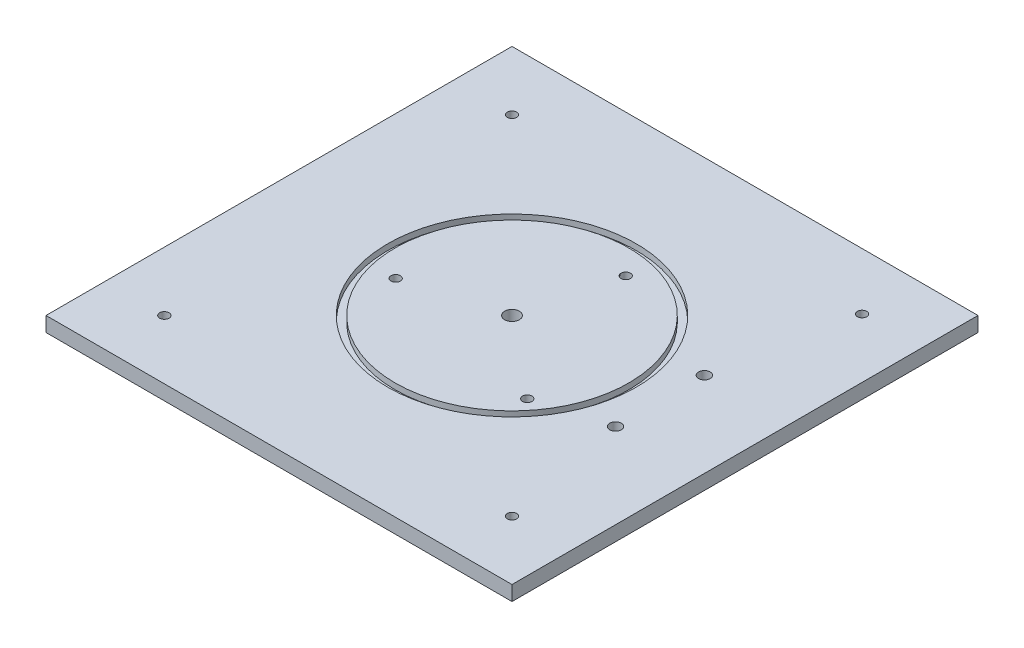
ISO-10303-21;
HEADER;
FILE_DESCRIPTION(('STEP AP214'),'2;1');
FILE_NAME('part.step','',(''),(''),'','','');
FILE_SCHEMA(('AUTOMOTIVE_DESIGN { 1 0 10303 214 1 1 1 1 }'));
ENDSEC;
DATA;
#1=APPLICATION_CONTEXT('core data for automotive mechanical design processes');
#2=APPLICATION_PROTOCOL_DEFINITION('international standard','automotive_design',2000,#1);
#3=PRODUCT_CONTEXT('',#1,'mechanical');
#4=PRODUCT('Part','Part','',(#3));
#5=PRODUCT_RELATED_PRODUCT_CATEGORY('part','',(#4));
#6=PRODUCT_DEFINITION_FORMATION('','',#4);
#7=PRODUCT_DEFINITION_CONTEXT('part definition',#1,'design');
#8=PRODUCT_DEFINITION('design','',#6,#7);
#9=PRODUCT_DEFINITION_SHAPE('','',#8);
#10=(LENGTH_UNIT() NAMED_UNIT(*) SI_UNIT(.MILLI.,.METRE.));
#11=(NAMED_UNIT(*) PLANE_ANGLE_UNIT() SI_UNIT($,.RADIAN.));
#12=(NAMED_UNIT(*) SI_UNIT($,.STERADIAN.) SOLID_ANGLE_UNIT());
#13=UNCERTAINTY_MEASURE_WITH_UNIT(LENGTH_MEASURE(1.E-05),#10,'distance_accuracy_value','');
#14=(GEOMETRIC_REPRESENTATION_CONTEXT(3) GLOBAL_UNCERTAINTY_ASSIGNED_CONTEXT((#13)) GLOBAL_UNIT_ASSIGNED_CONTEXT((#10,
#11,#12)) REPRESENTATION_CONTEXT('',''));
#15=CARTESIAN_POINT('',(0.,0.,0.));
#16=DIRECTION('',(0.,0.,1.));
#17=DIRECTION('',(1.,0.,0.));
#18=AXIS2_PLACEMENT_3D('',#15,#16,#17);
#19=CARTESIAN_POINT('',(0.,6.35,0.));
#20=DIRECTION('',(0.,1.,0.));
#21=DIRECTION('',(0.,0.,1.));
#22=AXIS2_PLACEMENT_3D('',#19,#20,#21);
#23=PLANE('',#22);
#24=CARTESIAN_POINT('',(9.69330275584784,6.35,-39.1400547767288));
#25=DIRECTION('',(0.,1.,0.));
#26=DIRECTION('',(0.,0.,1.));
#27=AXIS2_PLACEMENT_3D('',#24,#25,#26);
#28=CIRCLE('',#27,2.01929999999999);
#29=CARTESIAN_POINT('',(9.69330275584784,6.35,-37.1207547767289));
#30=VERTEX_POINT('',#29);
#31=EDGE_CURVE('E126',#30,#30,#28,.T.);
#32=ORIENTED_EDGE('',*,*,#31,.F.);
#33=EDGE_LOOP('',(#32));
#34=FACE_BOUND('',#33,.T.);
#35=CARTESIAN_POINT('',(-38.7429331202176,6.35,11.1753809551668));
#36=DIRECTION('',(0.,1.,0.));
#37=DIRECTION('',(0.,0.,1.));
#38=AXIS2_PLACEMENT_3D('',#35,#36,#37);
#39=CIRCLE('',#38,2.01929999999999);
#40=CARTESIAN_POINT('',(-38.7429331202176,6.35,13.1946809551668));
#41=VERTEX_POINT('',#40);
#42=EDGE_CURVE('E116',#41,#41,#39,.T.);
#43=ORIENTED_EDGE('',*,*,#42,.F.);
#44=EDGE_LOOP('',(#43));
#45=FACE_BOUND('',#44,.T.);
#46=CARTESIAN_POINT('',(34.2256428936894,6.35,27.6831374155974));
#47=DIRECTION('',(0.,1.,0.));
#48=DIRECTION('',(0.,0.,1.));
#49=AXIS2_PLACEMENT_3D('',#46,#47,#48);
#50=CIRCLE('',#49,2.01929999999999);
#51=CARTESIAN_POINT('',(34.2256428936894,6.35,29.7024374155973));
#52=VERTEX_POINT('',#51);
#53=EDGE_CURVE('E113',#52,#52,#50,.T.);
#54=ORIENTED_EDGE('',*,*,#53,.F.);
#55=EDGE_LOOP('',(#54));
#56=FACE_BOUND('',#55,.T.);
#57=CARTESIAN_POINT('',(0.,6.35,0.));
#58=DIRECTION('',(0.,1.,0.));
#59=DIRECTION('',(0.,0.,1.));
#60=AXIS2_PLACEMENT_3D('',#57,#58,#59);
#61=CIRCLE('',#60,3.175);
#62=CARTESIAN_POINT('',(0.,6.35,3.17499999999999));
#63=VERTEX_POINT('',#62);
#64=EDGE_CURVE('E151',#63,#63,#61,.T.);
#65=ORIENTED_EDGE('',*,*,#64,.F.);
#66=EDGE_LOOP('',(#65));
#67=FACE_BOUND('',#66,.T.);
#68=CARTESIAN_POINT('',(1.11022302462516E-13,6.35,0.));
#69=DIRECTION('',(0.,1.,0.));
#70=DIRECTION('',(0.,0.,1.));
#71=AXIS2_PLACEMENT_3D('',#68,#69,#70);
#72=CIRCLE('',#71,50.1649999999997);
#73=CARTESIAN_POINT('',(1.11022302462516E-13,6.35,50.1649999999997));
#74=VERTEX_POINT('',#73);
#75=EDGE_CURVE('E112',#74,#74,#72,.T.);
#76=ORIENTED_EDGE('',*,*,#75,.T.);
#77=EDGE_LOOP('',(#76));
#78=FACE_BOUND('',#77,.T.);
#79=ADVANCED_FACE('F34',(#34,#45,#56,#67,#78),#23,.T.);
#80=CARTESIAN_POINT('',(100.,6.35,-100.));
#81=DIRECTION('',(-1.,0.,0.));
#82=DIRECTION('',(0.,0.,1.));
#83=AXIS2_PLACEMENT_3D('',#80,#81,#82);
#84=PLANE('',#83);
#85=DIRECTION('',(0.,0.,-1.));
#86=VECTOR('',#85,1.);
#87=CARTESIAN_POINT('',(100.,0.,-100.));
#88=LINE('',#87,#86);
#89=CARTESIAN_POINT('',(100.,0.,100.));
#90=VERTEX_POINT('',#89);
#91=CARTESIAN_POINT('',(100.,0.,-100.));
#92=VERTEX_POINT('',#91);
#93=EDGE_CURVE('E101',#90,#92,#88,.T.);
#94=ORIENTED_EDGE('',*,*,#93,.T.);
#95=DIRECTION('',(0.,-1.,0.));
#96=VECTOR('',#95,1.);
#97=CARTESIAN_POINT('',(100.,6.35,-100.));
#98=LINE('',#97,#96);
#99=CARTESIAN_POINT('',(100.,6.35,-100.));
#100=VERTEX_POINT('',#99);
#101=EDGE_CURVE('E11',#100,#92,#98,.T.);
#102=ORIENTED_EDGE('',*,*,#101,.F.);
#103=DIRECTION('',(0.,0.,-1.));
#104=VECTOR('',#103,1.);
#105=CARTESIAN_POINT('',(100.,6.35,-100.));
#106=LINE('',#105,#104);
#107=CARTESIAN_POINT('',(100.,6.35,100.));
#108=VERTEX_POINT('',#107);
#109=EDGE_CURVE('E88',#108,#100,#106,.T.);
#110=ORIENTED_EDGE('',*,*,#109,.F.);
#111=DIRECTION('',(0.,-1.,0.));
#112=VECTOR('',#111,1.);
#113=CARTESIAN_POINT('',(100.,6.35,100.));
#114=LINE('',#113,#112);
#115=EDGE_CURVE('E97',#108,#90,#114,.T.);
#116=ORIENTED_EDGE('',*,*,#115,.T.);
#117=EDGE_LOOP('',(#94,#102,#110,#116));
#118=FACE_BOUND('',#117,.T.);
#119=ADVANCED_FACE('F36',(#118),#84,.F.);
#120=CARTESIAN_POINT('',(-100.,6.35,-100.));
#121=DIRECTION('',(0.,0.,1.));
#122=DIRECTION('',(1.,0.,0.));
#123=AXIS2_PLACEMENT_3D('',#120,#121,#122);
#124=PLANE('',#123);
#125=DIRECTION('',(-1.,0.,0.));
#126=VECTOR('',#125,1.);
#127=CARTESIAN_POINT('',(-100.,0.,-100.));
#128=LINE('',#127,#126);
#129=CARTESIAN_POINT('',(-100.,0.,-100.));
#130=VERTEX_POINT('',#129);
#131=EDGE_CURVE('E92',#92,#130,#128,.T.);
#132=ORIENTED_EDGE('',*,*,#131,.T.);
#133=DIRECTION('',(0.,-1.,0.));
#134=VECTOR('',#133,1.);
#135=CARTESIAN_POINT('',(-100.,6.35,-100.));
#136=LINE('',#135,#134);
#137=CARTESIAN_POINT('',(-100.,6.35,-100.));
#138=VERTEX_POINT('',#137);
#139=EDGE_CURVE('E44',#138,#130,#136,.T.);
#140=ORIENTED_EDGE('',*,*,#139,.F.);
#141=DIRECTION('',(-1.,0.,0.));
#142=VECTOR('',#141,1.);
#143=CARTESIAN_POINT('',(-100.,6.35,-100.));
#144=LINE('',#143,#142);
#145=EDGE_CURVE('E83',#100,#138,#144,.T.);
#146=ORIENTED_EDGE('',*,*,#145,.F.);
#147=ORIENTED_EDGE('',*,*,#101,.T.);
#148=EDGE_LOOP('',(#132,#140,#146,#147));
#149=FACE_BOUND('',#148,.T.);
#150=ADVANCED_FACE('F91',(#149),#124,.F.);
#151=CARTESIAN_POINT('',(-100.,6.35,-100.));
#152=DIRECTION('',(1.,0.,0.));
#153=DIRECTION('',(0.,0.,-1.));
#154=AXIS2_PLACEMENT_3D('',#151,#152,#153);
#155=PLANE('',#154);
#156=DIRECTION('',(0.,0.,1.));
#157=VECTOR('',#156,1.);
#158=CARTESIAN_POINT('',(-100.,0.,-100.));
#159=LINE('',#158,#157);
#160=CARTESIAN_POINT('',(-100.,0.,100.));
#161=VERTEX_POINT('',#160);
#162=EDGE_CURVE('E70',#130,#161,#159,.T.);
#163=ORIENTED_EDGE('',*,*,#162,.T.);
#164=DIRECTION('',(0.,-1.,0.));
#165=VECTOR('',#164,1.);
#166=CARTESIAN_POINT('',(-100.,6.35,100.));
#167=LINE('',#166,#165);
#168=CARTESIAN_POINT('',(-100.,6.35,100.));
#169=VERTEX_POINT('',#168);
#170=EDGE_CURVE('E93',#169,#161,#167,.T.);
#171=ORIENTED_EDGE('',*,*,#170,.F.);
#172=DIRECTION('',(0.,0.,1.));
#173=VECTOR('',#172,1.);
#174=CARTESIAN_POINT('',(-100.,6.35,-100.));
#175=LINE('',#174,#173);
#176=EDGE_CURVE('E86',#138,#169,#175,.T.);
#177=ORIENTED_EDGE('',*,*,#176,.F.);
#178=ORIENTED_EDGE('',*,*,#139,.T.);
#179=EDGE_LOOP('',(#163,#171,#177,#178));
#180=FACE_BOUND('',#179,.T.);
#181=ADVANCED_FACE('F95',(#180),#155,.F.);
#182=CARTESIAN_POINT('',(-100.,6.35,100.));
#183=DIRECTION('',(0.,0.,-1.));
#184=DIRECTION('',(-1.,0.,0.));
#185=AXIS2_PLACEMENT_3D('',#182,#183,#184);
#186=PLANE('',#185);
#187=DIRECTION('',(1.,0.,0.));
#188=VECTOR('',#187,1.);
#189=CARTESIAN_POINT('',(-100.,0.,100.));
#190=LINE('',#189,#188);
#191=EDGE_CURVE('E76',#161,#90,#190,.T.);
#192=ORIENTED_EDGE('',*,*,#191,.T.);
#193=ORIENTED_EDGE('',*,*,#115,.F.);
#194=DIRECTION('',(1.,0.,0.));
#195=VECTOR('',#194,1.);
#196=CARTESIAN_POINT('',(-100.,6.35,100.));
#197=LINE('',#196,#195);
#198=EDGE_CURVE('E53',#169,#108,#197,.T.);
#199=ORIENTED_EDGE('',*,*,#198,.F.);
#200=ORIENTED_EDGE('',*,*,#170,.T.);
#201=EDGE_LOOP('',(#192,#193,#199,#200));
#202=FACE_BOUND('',#201,.T.);
#203=ADVANCED_FACE('F201',(#202),#186,.F.);
#204=CARTESIAN_POINT('',(-74.6,6.35,74.6));
#205=DIRECTION('',(0.,1.,0.));
#206=DIRECTION('',(0.,0.,1.));
#207=AXIS2_PLACEMENT_3D('',#204,#205,#206);
#208=CIRCLE('',#207,2.03200000000001);
#209=CARTESIAN_POINT('',(-74.6,6.35,76.632));
#210=VERTEX_POINT('',#209);
#211=EDGE_CURVE('E317',#210,#210,#208,.T.);
#212=ORIENTED_EDGE('',*,*,#211,.F.);
#213=EDGE_LOOP('',(#212));
#214=FACE_BOUND('',#213,.T.);
#215=CARTESIAN_POINT('',(74.6,6.35,74.6));
#216=DIRECTION('',(0.,1.,0.));
#217=DIRECTION('',(0.,0.,1.));
#218=AXIS2_PLACEMENT_3D('',#215,#216,#217);
#219=CIRCLE('',#218,2.01999999999999);
#220=CARTESIAN_POINT('',(74.6,6.35,76.62));
#221=VERTEX_POINT('',#220);
#222=EDGE_CURVE('E319',#221,#221,#219,.T.);
#223=ORIENTED_EDGE('',*,*,#222,.F.);
#224=EDGE_LOOP('',(#223));
#225=FACE_BOUND('',#224,.T.);
#226=CARTESIAN_POINT('',(74.6,6.35,-75.6605977766913));
#227=DIRECTION('',(0.,1.,0.));
#228=DIRECTION('',(0.,0.,1.));
#229=AXIS2_PLACEMENT_3D('',#226,#227,#228);
#230=CIRCLE('',#229,2.01999999999999);
#231=CARTESIAN_POINT('',(74.6,6.35,-73.6405977766913));
#232=VERTEX_POINT('',#231);
#233=EDGE_CURVE('E325',#232,#232,#230,.T.);
#234=ORIENTED_EDGE('',*,*,#233,.F.);
#235=EDGE_LOOP('',(#234));
#236=FACE_BOUND('',#235,.T.);
#237=CARTESIAN_POINT('',(-74.6,6.35,-74.6));
#238=DIRECTION('',(0.,1.,0.));
#239=DIRECTION('',(0.,0.,1.));
#240=AXIS2_PLACEMENT_3D('',#237,#238,#239);
#241=CIRCLE('',#240,2.01999999999999);
#242=CARTESIAN_POINT('',(-74.6,6.35,-72.58));
#243=VERTEX_POINT('',#242);
#244=EDGE_CURVE('E331',#243,#243,#241,.T.);
#245=ORIENTED_EDGE('',*,*,#244,.F.);
#246=EDGE_LOOP('',(#245));
#247=FACE_BOUND('',#246,.T.);
#248=CARTESIAN_POINT('',(1.11022302462516E-13,6.35,0.));
#249=DIRECTION('',(0.,1.,0.));
#250=DIRECTION('',(0.,0.,1.));
#251=AXIS2_PLACEMENT_3D('',#248,#249,#250);
#252=CIRCLE('',#251,53.3399999999997);
#253=CARTESIAN_POINT('',(1.11022302462516E-13,6.35,53.3399999999996));
#254=VERTEX_POINT('',#253);
#255=EDGE_CURVE('E133',#254,#254,#252,.T.);
#256=ORIENTED_EDGE('',*,*,#255,.F.);
#257=EDGE_LOOP('',(#256));
#258=FACE_BOUND('',#257,.T.);
#259=CARTESIAN_POINT('',(63.5000000000001,6.35,-19.0500000000001));
#260=DIRECTION('',(0.,1.,0.));
#261=DIRECTION('',(0.,0.,1.));
#262=AXIS2_PLACEMENT_3D('',#259,#260,#261);
#263=CIRCLE('',#262,2.48919999999999);
#264=CARTESIAN_POINT('',(63.5000000000001,6.35,-16.5608000000001));
#265=VERTEX_POINT('',#264);
#266=EDGE_CURVE('E139',#265,#265,#263,.T.);
#267=ORIENTED_EDGE('',*,*,#266,.F.);
#268=EDGE_LOOP('',(#267));
#269=FACE_BOUND('',#268,.T.);
#270=CARTESIAN_POINT('',(63.5,6.35,19.0499999999999));
#271=DIRECTION('',(0.,1.,0.));
#272=DIRECTION('',(0.,0.,1.));
#273=AXIS2_PLACEMENT_3D('',#270,#271,#272);
#274=CIRCLE('',#273,2.48919999999999);
#275=CARTESIAN_POINT('',(63.5,6.35,21.5391999999999));
#276=VERTEX_POINT('',#275);
#277=EDGE_CURVE('E145',#276,#276,#274,.T.);
#278=ORIENTED_EDGE('',*,*,#277,.F.);
#279=EDGE_LOOP('',(#278));
#280=FACE_BOUND('',#279,.T.);
#281=ORIENTED_EDGE('',*,*,#109,.T.);
#282=ORIENTED_EDGE('',*,*,#145,.T.);
#283=ORIENTED_EDGE('',*,*,#176,.T.);
#284=ORIENTED_EDGE('',*,*,#198,.T.);
#285=EDGE_LOOP('',(#281,#282,#283,#284));
#286=FACE_BOUND('',#285,.T.);
#287=ADVANCED_FACE('F84',(#214,#225,#236,#247,#258,#269,#280,#286),#23,.T.);
#288=CARTESIAN_POINT('',(0.,0.,0.));
#289=DIRECTION('',(0.,1.,0.));
#290=DIRECTION('',(0.,0.,1.));
#291=AXIS2_PLACEMENT_3D('',#288,#289,#290);
#292=PLANE('',#291);
#293=CARTESIAN_POINT('',(-74.6,0.,74.6));
#294=DIRECTION('',(0.,1.,0.));
#295=DIRECTION('',(0.,0.,1.));
#296=AXIS2_PLACEMENT_3D('',#293,#294,#295);
#297=CIRCLE('',#296,2.03200000000001);
#298=CARTESIAN_POINT('',(-74.6,0.,76.632));
#299=VERTEX_POINT('',#298);
#300=EDGE_CURVE('E314',#299,#299,#297,.T.);
#301=ORIENTED_EDGE('',*,*,#300,.T.);
#302=EDGE_LOOP('',(#301));
#303=FACE_BOUND('',#302,.T.);
#304=CARTESIAN_POINT('',(74.6,0.,74.6));
#305=DIRECTION('',(0.,1.,0.));
#306=DIRECTION('',(0.,0.,1.));
#307=AXIS2_PLACEMENT_3D('',#304,#305,#306);
#308=CIRCLE('',#307,2.01999999999999);
#309=CARTESIAN_POINT('',(74.6,0.,76.62));
#310=VERTEX_POINT('',#309);
#311=EDGE_CURVE('E322',#310,#310,#308,.T.);
#312=ORIENTED_EDGE('',*,*,#311,.T.);
#313=EDGE_LOOP('',(#312));
#314=FACE_BOUND('',#313,.T.);
#315=CARTESIAN_POINT('',(74.6,0.,-75.6605977766913));
#316=DIRECTION('',(0.,1.,0.));
#317=DIRECTION('',(0.,0.,1.));
#318=AXIS2_PLACEMENT_3D('',#315,#316,#317);
#319=CIRCLE('',#318,2.01999999999999);
#320=CARTESIAN_POINT('',(74.6,0.,-73.6405977766913));
#321=VERTEX_POINT('',#320);
#322=EDGE_CURVE('E328',#321,#321,#319,.T.);
#323=ORIENTED_EDGE('',*,*,#322,.T.);
#324=EDGE_LOOP('',(#323));
#325=FACE_BOUND('',#324,.T.);
#326=CARTESIAN_POINT('',(-74.6,0.,-74.6));
#327=DIRECTION('',(0.,1.,0.));
#328=DIRECTION('',(0.,0.,1.));
#329=AXIS2_PLACEMENT_3D('',#326,#327,#328);
#330=CIRCLE('',#329,2.01999999999999);
#331=CARTESIAN_POINT('',(-74.6,0.,-72.58));
#332=VERTEX_POINT('',#331);
#333=EDGE_CURVE('E334',#332,#332,#330,.T.);
#334=ORIENTED_EDGE('',*,*,#333,.T.);
#335=EDGE_LOOP('',(#334));
#336=FACE_BOUND('',#335,.T.);
#337=CARTESIAN_POINT('',(9.69330275584784,0.,-39.1400547767288));
#338=DIRECTION('',(0.,1.,0.));
#339=DIRECTION('',(0.,0.,1.));
#340=AXIS2_PLACEMENT_3D('',#337,#338,#339);
#341=CIRCLE('',#340,2.01929999999999);
#342=CARTESIAN_POINT('',(9.69330275584784,0.,-37.1207547767288));
#343=VERTEX_POINT('',#342);
#344=EDGE_CURVE('E38',#343,#343,#341,.T.);
#345=ORIENTED_EDGE('',*,*,#344,.T.);
#346=EDGE_LOOP('',(#345));
#347=FACE_BOUND('',#346,.T.);
#348=CARTESIAN_POINT('',(-38.7429331202176,0.,11.1753809551668));
#349=DIRECTION('',(0.,1.,0.));
#350=DIRECTION('',(0.,0.,1.));
#351=AXIS2_PLACEMENT_3D('',#348,#349,#350);
#352=CIRCLE('',#351,2.01929999999999);
#353=CARTESIAN_POINT('',(-38.7429331202176,0.,13.1946809551668));
#354=VERTEX_POINT('',#353);
#355=EDGE_CURVE('E114',#354,#354,#352,.T.);
#356=ORIENTED_EDGE('',*,*,#355,.T.);
#357=EDGE_LOOP('',(#356));
#358=FACE_BOUND('',#357,.T.);
#359=CARTESIAN_POINT('',(34.2256428936894,0.,27.6831374155974));
#360=DIRECTION('',(0.,1.,0.));
#361=DIRECTION('',(0.,0.,1.));
#362=AXIS2_PLACEMENT_3D('',#359,#360,#361);
#363=CIRCLE('',#362,2.01929999999999);
#364=CARTESIAN_POINT('',(34.2256428936894,0.,29.7024374155973));
#365=VERTEX_POINT('',#364);
#366=EDGE_CURVE('E110',#365,#365,#363,.T.);
#367=ORIENTED_EDGE('',*,*,#366,.T.);
#368=EDGE_LOOP('',(#367));
#369=FACE_BOUND('',#368,.T.);
#370=CARTESIAN_POINT('',(63.5000000000001,0.,-19.0500000000001));
#371=DIRECTION('',(0.,1.,0.));
#372=DIRECTION('',(0.,0.,1.));
#373=AXIS2_PLACEMENT_3D('',#370,#371,#372);
#374=CIRCLE('',#373,2.48919999999999);
#375=CARTESIAN_POINT('',(63.5000000000001,0.,-16.5608000000001));
#376=VERTEX_POINT('',#375);
#377=EDGE_CURVE('E142',#376,#376,#374,.T.);
#378=ORIENTED_EDGE('',*,*,#377,.T.);
#379=EDGE_LOOP('',(#378));
#380=FACE_BOUND('',#379,.T.);
#381=CARTESIAN_POINT('',(63.5,0.,19.0499999999999));
#382=DIRECTION('',(0.,1.,0.));
#383=DIRECTION('',(0.,0.,1.));
#384=AXIS2_PLACEMENT_3D('',#381,#382,#383);
#385=CIRCLE('',#384,2.48919999999999);
#386=CARTESIAN_POINT('',(63.5,0.,21.5391999999999));
#387=VERTEX_POINT('',#386);
#388=EDGE_CURVE('E148',#387,#387,#385,.T.);
#389=ORIENTED_EDGE('',*,*,#388,.T.);
#390=EDGE_LOOP('',(#389));
#391=FACE_BOUND('',#390,.T.);
#392=CARTESIAN_POINT('',(0.,0.,0.));
#393=DIRECTION('',(0.,1.,0.));
#394=DIRECTION('',(0.,0.,1.));
#395=AXIS2_PLACEMENT_3D('',#392,#393,#394);
#396=CIRCLE('',#395,3.175);
#397=CARTESIAN_POINT('',(0.,0.,3.17499999999999));
#398=VERTEX_POINT('',#397);
#399=EDGE_CURVE('E104',#398,#398,#396,.T.);
#400=ORIENTED_EDGE('',*,*,#399,.T.);
#401=EDGE_LOOP('',(#400));
#402=FACE_BOUND('',#401,.T.);
#403=ORIENTED_EDGE('',*,*,#93,.F.);
#404=ORIENTED_EDGE('',*,*,#191,.F.);
#405=ORIENTED_EDGE('',*,*,#162,.F.);
#406=ORIENTED_EDGE('',*,*,#131,.F.);
#407=EDGE_LOOP('',(#403,#404,#405,#406));
#408=FACE_BOUND('',#407,.T.);
#409=ADVANCED_FACE('F197',(#303,#314,#325,#336,#347,#358,#369,#380,#391,#402,#408),#292,.F.);
#410=CARTESIAN_POINT('',(0.,0.,0.));
#411=DIRECTION('',(0.,1.,0.));
#412=DIRECTION('',(0.,0.,1.));
#413=AXIS2_PLACEMENT_3D('',#410,#411,#412);
#414=CYLINDRICAL_SURFACE('',#413,3.175);
#415=ORIENTED_EDGE('',*,*,#399,.F.);
#416=EDGE_LOOP('',(#415));
#417=FACE_BOUND('',#416,.T.);
#418=ORIENTED_EDGE('',*,*,#64,.T.);
#419=EDGE_LOOP('',(#418));
#420=FACE_BOUND('',#419,.T.);
#421=ADVANCED_FACE('F159',(#417,#420),#414,.F.);
#422=CARTESIAN_POINT('',(63.5,0.,19.0499999999999));
#423=DIRECTION('',(0.,1.,0.));
#424=DIRECTION('',(0.,0.,1.));
#425=AXIS2_PLACEMENT_3D('',#422,#423,#424);
#426=CYLINDRICAL_SURFACE('',#425,2.48919999999999);
#427=ORIENTED_EDGE('',*,*,#388,.F.);
#428=EDGE_LOOP('',(#427));
#429=FACE_BOUND('',#428,.T.);
#430=ORIENTED_EDGE('',*,*,#277,.T.);
#431=EDGE_LOOP('',(#430));
#432=FACE_BOUND('',#431,.T.);
#433=ADVANCED_FACE('F191',(#429,#432),#426,.F.);
#434=CARTESIAN_POINT('',(63.5000000000001,0.,-19.0500000000001));
#435=DIRECTION('',(0.,1.,0.));
#436=DIRECTION('',(0.,0.,1.));
#437=AXIS2_PLACEMENT_3D('',#434,#435,#436);
#438=CYLINDRICAL_SURFACE('',#437,2.48919999999999);
#439=ORIENTED_EDGE('',*,*,#377,.F.);
#440=EDGE_LOOP('',(#439));
#441=FACE_BOUND('',#440,.T.);
#442=ORIENTED_EDGE('',*,*,#266,.T.);
#443=EDGE_LOOP('',(#442));
#444=FACE_BOUND('',#443,.T.);
#445=ADVANCED_FACE('F187',(#441,#444),#438,.F.);
#446=CARTESIAN_POINT('',(1.11022302462516E-13,3.81,0.));
#447=DIRECTION('',(0.,1.,0.));
#448=DIRECTION('',(0.,0.,1.));
#449=AXIS2_PLACEMENT_3D('',#446,#447,#448);
#450=CYLINDRICAL_SURFACE('',#449,53.3399999999997);
#451=CARTESIAN_POINT('',(1.11022302462516E-13,3.81,0.));
#452=DIRECTION('',(0.,1.,0.));
#453=DIRECTION('',(0.,0.,1.));
#454=AXIS2_PLACEMENT_3D('',#451,#452,#453);
#455=CIRCLE('',#454,53.3399999999997);
#456=CARTESIAN_POINT('',(1.11022302462516E-13,3.81,53.3399999999996));
#457=VERTEX_POINT('',#456);
#458=EDGE_CURVE('E136',#457,#457,#455,.T.);
#459=ORIENTED_EDGE('',*,*,#458,.F.);
#460=EDGE_LOOP('',(#459));
#461=FACE_BOUND('',#460,.T.);
#462=ORIENTED_EDGE('',*,*,#255,.T.);
#463=EDGE_LOOP('',(#462));
#464=FACE_BOUND('',#463,.T.);
#465=ADVANCED_FACE('F180',(#461,#464),#450,.F.);
#466=CARTESIAN_POINT('',(1.11022302462516E-13,3.81,0.));
#467=DIRECTION('',(0.,1.,0.));
#468=DIRECTION('',(0.,0.,1.));
#469=AXIS2_PLACEMENT_3D('',#466,#467,#468);
#470=PLANE('',#469);
#471=CARTESIAN_POINT('',(1.11022302462516E-13,3.81,0.));
#472=DIRECTION('',(0.,1.,0.));
#473=DIRECTION('',(0.,0.,1.));
#474=AXIS2_PLACEMENT_3D('',#471,#472,#473);
#475=CIRCLE('',#474,50.1649999999997);
#476=CARTESIAN_POINT('',(1.11022302462516E-13,3.81,50.1649999999997));
#477=VERTEX_POINT('',#476);
#478=EDGE_CURVE('E130',#477,#477,#475,.T.);
#479=ORIENTED_EDGE('',*,*,#478,.F.);
#480=EDGE_LOOP('',(#479));
#481=FACE_BOUND('',#480,.T.);
#482=ORIENTED_EDGE('',*,*,#458,.T.);
#483=EDGE_LOOP('',(#482));
#484=FACE_BOUND('',#483,.T.);
#485=ADVANCED_FACE('F170',(#481,#484),#470,.T.);
#486=CARTESIAN_POINT('',(1.11022302462516E-13,3.81,0.));
#487=DIRECTION('',(0.,1.,0.));
#488=DIRECTION('',(0.,0.,1.));
#489=AXIS2_PLACEMENT_3D('',#486,#487,#488);
#490=CYLINDRICAL_SURFACE('',#489,50.1649999999997);
#491=ORIENTED_EDGE('',*,*,#478,.T.);
#492=EDGE_LOOP('',(#491));
#493=FACE_BOUND('',#492,.T.);
#494=ORIENTED_EDGE('',*,*,#75,.F.);
#495=EDGE_LOOP('',(#494));
#496=FACE_BOUND('',#495,.T.);
#497=ADVANCED_FACE('F167',(#493,#496),#490,.T.);
#498=CARTESIAN_POINT('',(34.2256428936894,6.35,27.6831374155974));
#499=DIRECTION('',(0.,1.,0.));
#500=DIRECTION('',(0.,0.,1.));
#501=AXIS2_PLACEMENT_3D('',#498,#499,#500);
#502=CYLINDRICAL_SURFACE('',#501,2.01929999999999);
#503=ORIENTED_EDGE('',*,*,#53,.T.);
#504=EDGE_LOOP('',(#503));
#505=FACE_BOUND('',#504,.T.);
#506=ORIENTED_EDGE('',*,*,#366,.F.);
#507=EDGE_LOOP('',(#506));
#508=FACE_BOUND('',#507,.T.);
#509=ADVANCED_FACE('F169',(#505,#508),#502,.F.);
#510=CARTESIAN_POINT('',(-38.7429331202176,6.35,11.1753809551668));
#511=DIRECTION('',(0.,1.,0.));
#512=DIRECTION('',(0.,0.,1.));
#513=AXIS2_PLACEMENT_3D('',#510,#511,#512);
#514=CYLINDRICAL_SURFACE('',#513,2.01929999999999);
#515=ORIENTED_EDGE('',*,*,#42,.T.);
#516=EDGE_LOOP('',(#515));
#517=FACE_BOUND('',#516,.T.);
#518=ORIENTED_EDGE('',*,*,#355,.F.);
#519=EDGE_LOOP('',(#518));
#520=FACE_BOUND('',#519,.T.);
#521=ADVANCED_FACE('F177',(#517,#520),#514,.F.);
#522=CARTESIAN_POINT('',(9.69330275584784,6.35,-39.1400547767288));
#523=DIRECTION('',(0.,1.,0.));
#524=DIRECTION('',(0.,0.,1.));
#525=AXIS2_PLACEMENT_3D('',#522,#523,#524);
#526=CYLINDRICAL_SURFACE('',#525,2.01929999999999);
#527=ORIENTED_EDGE('',*,*,#31,.T.);
#528=EDGE_LOOP('',(#527));
#529=FACE_BOUND('',#528,.T.);
#530=ORIENTED_EDGE('',*,*,#344,.F.);
#531=EDGE_LOOP('',(#530));
#532=FACE_BOUND('',#531,.T.);
#533=ADVANCED_FACE('F244',(#529,#532),#526,.F.);
#534=CARTESIAN_POINT('',(-74.6,0.,-74.6));
#535=DIRECTION('',(0.,1.,0.));
#536=DIRECTION('',(0.,0.,1.));
#537=AXIS2_PLACEMENT_3D('',#534,#535,#536);
#538=CYLINDRICAL_SURFACE('',#537,2.01999999999999);
#539=ORIENTED_EDGE('',*,*,#333,.F.);
#540=EDGE_LOOP('',(#539));
#541=FACE_BOUND('',#540,.T.);
#542=ORIENTED_EDGE('',*,*,#244,.T.);
#543=EDGE_LOOP('',(#542));
#544=FACE_BOUND('',#543,.T.);
#545=ADVANCED_FACE('F253',(#541,#544),#538,.F.);
#546=CARTESIAN_POINT('',(74.6,0.,-75.6605977766913));
#547=DIRECTION('',(0.,1.,0.));
#548=DIRECTION('',(0.,0.,1.));
#549=AXIS2_PLACEMENT_3D('',#546,#547,#548);
#550=CYLINDRICAL_SURFACE('',#549,2.01999999999999);
#551=ORIENTED_EDGE('',*,*,#322,.F.);
#552=EDGE_LOOP('',(#551));
#553=FACE_BOUND('',#552,.T.);
#554=ORIENTED_EDGE('',*,*,#233,.T.);
#555=EDGE_LOOP('',(#554));
#556=FACE_BOUND('',#555,.T.);
#557=ADVANCED_FACE('F277',(#553,#556),#550,.F.);
#558=CARTESIAN_POINT('',(74.6,0.,74.6));
#559=DIRECTION('',(0.,1.,0.));
#560=DIRECTION('',(0.,0.,1.));
#561=AXIS2_PLACEMENT_3D('',#558,#559,#560);
#562=CYLINDRICAL_SURFACE('',#561,2.01999999999999);
#563=ORIENTED_EDGE('',*,*,#311,.F.);
#564=EDGE_LOOP('',(#563));
#565=FACE_BOUND('',#564,.T.);
#566=ORIENTED_EDGE('',*,*,#222,.T.);
#567=EDGE_LOOP('',(#566));
#568=FACE_BOUND('',#567,.T.);
#569=ADVANCED_FACE('F287',(#565,#568),#562,.F.);
#570=CARTESIAN_POINT('',(-74.6,0.,74.6));
#571=DIRECTION('',(0.,1.,0.));
#572=DIRECTION('',(0.,0.,1.));
#573=AXIS2_PLACEMENT_3D('',#570,#571,#572);
#574=CYLINDRICAL_SURFACE('',#573,2.03200000000001);
#575=ORIENTED_EDGE('',*,*,#300,.F.);
#576=EDGE_LOOP('',(#575));
#577=FACE_BOUND('',#576,.T.);
#578=ORIENTED_EDGE('',*,*,#211,.T.);
#579=EDGE_LOOP('',(#578));
#580=FACE_BOUND('',#579,.T.);
#581=ADVANCED_FACE('F297',(#577,#580),#574,.F.);
#582=CLOSED_SHELL('',(#79,#119,#150,#181,#203,#287,#409,#421,#433,#445,#465,#485,#497,#509,#521,
#533,#545,#557,#569,#581));
#583=MANIFOLD_SOLID_BREP('B2',#582);
#584=ADVANCED_BREP_SHAPE_REPRESENTATION('',(#18,#583),#14);
#585=SHAPE_DEFINITION_REPRESENTATION(#9,#584);
ENDSEC;
END-ISO-10303-21;
